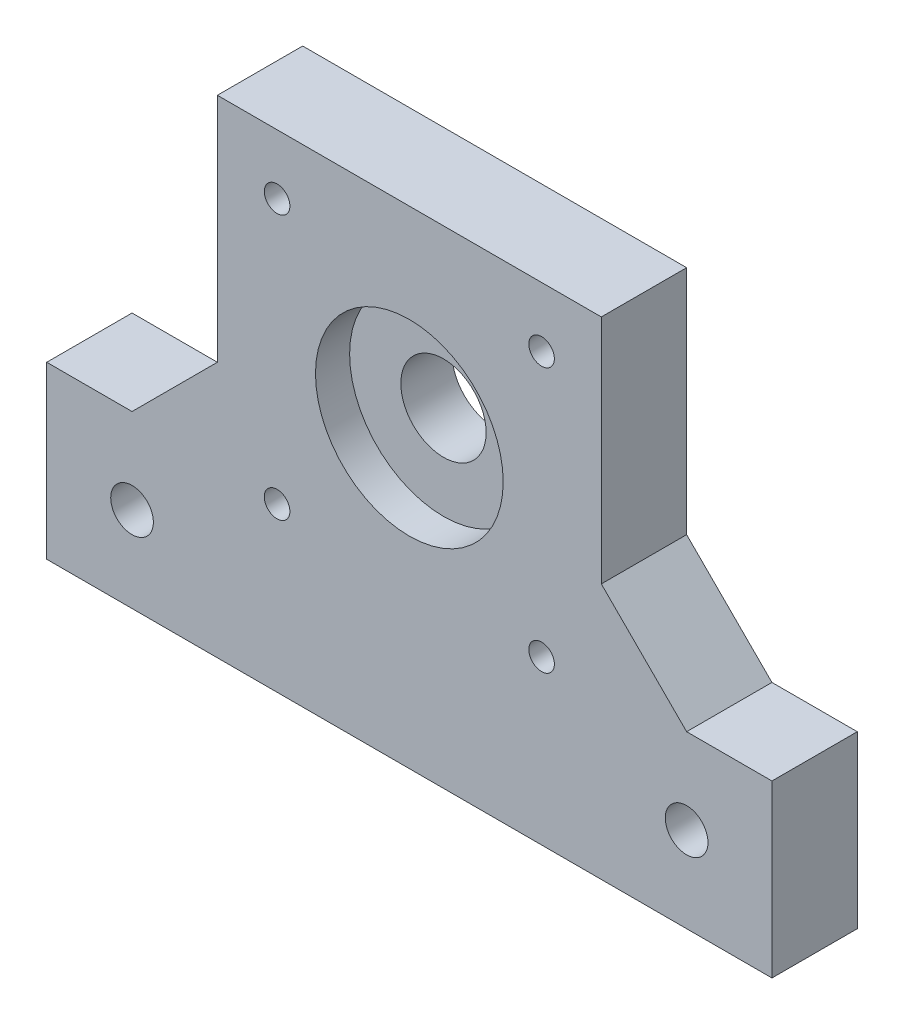
ISO-10303-21;
HEADER;
FILE_DESCRIPTION(('STEP AP214'),'2;1');
FILE_NAME('part.step','',(''),(''),'','','');
FILE_SCHEMA(('AUTOMOTIVE_DESIGN { 1 0 10303 214 1 1 1 1 }'));
ENDSEC;
DATA;
#1=APPLICATION_CONTEXT('core data for automotive mechanical design processes');
#2=APPLICATION_PROTOCOL_DEFINITION('international standard','automotive_design',2000,#1);
#3=PRODUCT_CONTEXT('',#1,'mechanical');
#4=PRODUCT('Part','Part','',(#3));
#5=PRODUCT_RELATED_PRODUCT_CATEGORY('part','',(#4));
#6=PRODUCT_DEFINITION_FORMATION('','',#4);
#7=PRODUCT_DEFINITION_CONTEXT('part definition',#1,'design');
#8=PRODUCT_DEFINITION('design','',#6,#7);
#9=PRODUCT_DEFINITION_SHAPE('','',#8);
#10=(LENGTH_UNIT() NAMED_UNIT(*) SI_UNIT(.MILLI.,.METRE.));
#11=(NAMED_UNIT(*) PLANE_ANGLE_UNIT() SI_UNIT($,.RADIAN.));
#12=(NAMED_UNIT(*) SI_UNIT($,.STERADIAN.) SOLID_ANGLE_UNIT());
#13=UNCERTAINTY_MEASURE_WITH_UNIT(LENGTH_MEASURE(1.E-05),#10,'distance_accuracy_value','');
#14=(GEOMETRIC_REPRESENTATION_CONTEXT(3) GLOBAL_UNCERTAINTY_ASSIGNED_CONTEXT((#13)) GLOBAL_UNIT_ASSIGNED_CONTEXT((#10,
#11,#12)) REPRESENTATION_CONTEXT('',''));
#15=CARTESIAN_POINT('',(0.,0.,0.));
#16=DIRECTION('',(0.,0.,1.));
#17=DIRECTION('',(1.,0.,0.));
#18=AXIS2_PLACEMENT_3D('',#15,#16,#17);
#19=CARTESIAN_POINT('',(15.5,15.5,10.));
#20=DIRECTION('',(0.,0.,-1.));
#21=DIRECTION('',(-1.,0.,0.));
#22=AXIS2_PLACEMENT_3D('',#19,#20,#21);
#23=CYLINDRICAL_SURFACE('',#22,1.5);
#24=CARTESIAN_POINT('',(15.5,15.5,10.));
#25=DIRECTION('',(0.,0.,1.));
#26=DIRECTION('',(-1.,0.,0.));
#27=AXIS2_PLACEMENT_3D('',#24,#25,#26);
#28=CIRCLE('',#27,1.5);
#29=CARTESIAN_POINT('',(14.,15.5,10.));
#30=VERTEX_POINT('',#29);
#31=EDGE_CURVE('E241',#30,#30,#28,.T.);
#32=ORIENTED_EDGE('',*,*,#31,.T.);
#33=EDGE_LOOP('',(#32));
#34=FACE_BOUND('',#33,.T.);
#35=CARTESIAN_POINT('',(15.5,15.5,4.));
#36=DIRECTION('',(0.,0.,-1.));
#37=DIRECTION('',(-1.,0.,0.));
#38=AXIS2_PLACEMENT_3D('',#35,#36,#37);
#39=CIRCLE('',#38,1.5);
#40=CARTESIAN_POINT('',(14.,15.5,4.));
#41=VERTEX_POINT('',#40);
#42=EDGE_CURVE('E208',#41,#41,#39,.T.);
#43=ORIENTED_EDGE('',*,*,#42,.T.);
#44=EDGE_LOOP('',(#43));
#45=FACE_BOUND('',#44,.T.);
#46=ADVANCED_FACE('F37',(#34,#45),#23,.F.);
#47=CARTESIAN_POINT('',(-15.5,-15.5,10.));
#48=DIRECTION('',(0.,0.,-1.));
#49=DIRECTION('',(-1.,0.,0.));
#50=AXIS2_PLACEMENT_3D('',#47,#48,#49);
#51=CYLINDRICAL_SURFACE('',#50,1.5);
#52=CARTESIAN_POINT('',(-15.5,-15.5,10.));
#53=DIRECTION('',(0.,0.,1.));
#54=DIRECTION('',(-1.,0.,0.));
#55=AXIS2_PLACEMENT_3D('',#52,#53,#54);
#56=CIRCLE('',#55,1.5);
#57=CARTESIAN_POINT('',(-17.,-15.5,10.));
#58=VERTEX_POINT('',#57);
#59=EDGE_CURVE('E233',#58,#58,#56,.T.);
#60=ORIENTED_EDGE('',*,*,#59,.T.);
#61=EDGE_LOOP('',(#60));
#62=FACE_BOUND('',#61,.T.);
#63=CARTESIAN_POINT('',(-15.5,-15.5,4.));
#64=DIRECTION('',(0.,0.,-1.));
#65=DIRECTION('',(-1.,0.,0.));
#66=AXIS2_PLACEMENT_3D('',#63,#64,#65);
#67=CIRCLE('',#66,1.5);
#68=CARTESIAN_POINT('',(-17.,-15.5,4.));
#69=VERTEX_POINT('',#68);
#70=EDGE_CURVE('E202',#69,#69,#67,.T.);
#71=ORIENTED_EDGE('',*,*,#70,.T.);
#72=EDGE_LOOP('',(#71));
#73=FACE_BOUND('',#72,.T.);
#74=ADVANCED_FACE('F281',(#62,#73),#51,.F.);
#75=CARTESIAN_POINT('',(0.,0.,10.));
#76=DIRECTION('',(0.,0.,-1.));
#77=DIRECTION('',(-1.,0.,0.));
#78=AXIS2_PLACEMENT_3D('',#75,#76,#77);
#79=CYLINDRICAL_SURFACE('',#78,5.);
#80=CARTESIAN_POINT('',(0.,0.,0.));
#81=DIRECTION('',(0.,0.,1.));
#82=DIRECTION('',(1.,0.,0.));
#83=AXIS2_PLACEMENT_3D('',#80,#81,#82);
#84=CIRCLE('',#83,5.);
#85=CARTESIAN_POINT('',(5.,0.,0.));
#86=VERTEX_POINT('',#85);
#87=EDGE_CURVE('E160',#86,#86,#84,.T.);
#88=ORIENTED_EDGE('',*,*,#87,.F.);
#89=EDGE_LOOP('',(#88));
#90=FACE_BOUND('',#89,.T.);
#91=CARTESIAN_POINT('',(0.,0.,6.));
#92=DIRECTION('',(0.,0.,1.));
#93=DIRECTION('',(1.,0.,0.));
#94=AXIS2_PLACEMENT_3D('',#91,#92,#93);
#95=CIRCLE('',#94,5.);
#96=CARTESIAN_POINT('',(5.,0.,6.));
#97=VERTEX_POINT('',#96);
#98=EDGE_CURVE('E186',#97,#97,#95,.T.);
#99=ORIENTED_EDGE('',*,*,#98,.T.);
#100=EDGE_LOOP('',(#99));
#101=FACE_BOUND('',#100,.T.);
#102=ADVANCED_FACE('F287',(#90,#101),#79,.F.);
#103=CARTESIAN_POINT('',(0.,0.,10.));
#104=DIRECTION('',(0.,0.,-1.));
#105=DIRECTION('',(-1.,0.,0.));
#106=AXIS2_PLACEMENT_3D('',#103,#104,#105);
#107=PLANE('',#106);
#108=CARTESIAN_POINT('',(0.,0.,10.));
#109=DIRECTION('',(0.,0.,1.));
#110=DIRECTION('',(1.,0.,0.));
#111=AXIS2_PLACEMENT_3D('',#108,#109,#110);
#112=CIRCLE('',#111,11.);
#113=CARTESIAN_POINT('',(11.,0.,10.));
#114=VERTEX_POINT('',#113);
#115=EDGE_CURVE('E213',#114,#114,#112,.T.);
#116=ORIENTED_EDGE('',*,*,#115,.F.);
#117=EDGE_LOOP('',(#116));
#118=FACE_BOUND('',#117,.T.);
#119=DIRECTION('',(0.,-1.,0.));
#120=VECTOR('',#119,1.);
#121=CARTESIAN_POINT('',(-22.5,22.5,10.));
#122=LINE('',#121,#120);
#123=CARTESIAN_POINT('',(-22.5,22.5,10.));
#124=VERTEX_POINT('',#123);
#125=CARTESIAN_POINT('',(-22.5,-4.60000000000002,10.));
#126=VERTEX_POINT('',#125);
#127=EDGE_CURVE('E128',#124,#126,#122,.T.);
#128=ORIENTED_EDGE('',*,*,#127,.T.);
#129=DIRECTION('',(0.707106781186552,0.707106781186543,0.));
#130=VECTOR('',#129,1.);
#131=CARTESIAN_POINT('',(-8.94999999999985,8.94999999999996,10.));
#132=LINE('',#131,#130);
#133=CARTESIAN_POINT('',(-32.5000000000001,-14.6,10.));
#134=VERTEX_POINT('',#133);
#135=EDGE_CURVE('E124',#126,#134,#132,.F.);
#136=ORIENTED_EDGE('',*,*,#135,.T.);
#137=DIRECTION('',(-1.,0.,0.));
#138=VECTOR('',#137,1.);
#139=CARTESIAN_POINT('',(-22.5,-14.6,10.));
#140=LINE('',#139,#138);
#141=CARTESIAN_POINT('',(-42.5,-14.6,10.));
#142=VERTEX_POINT('',#141);
#143=EDGE_CURVE('E115',#134,#142,#140,.T.);
#144=ORIENTED_EDGE('',*,*,#143,.T.);
#145=DIRECTION('',(0.,-1.,0.));
#146=VECTOR('',#145,1.);
#147=CARTESIAN_POINT('',(-42.5,-14.6,10.));
#148=LINE('',#147,#146);
#149=CARTESIAN_POINT('',(-42.5,-34.6,10.));
#150=VERTEX_POINT('',#149);
#151=EDGE_CURVE('E121',#142,#150,#148,.T.);
#152=ORIENTED_EDGE('',*,*,#151,.T.);
#153=DIRECTION('',(1.,0.,0.));
#154=VECTOR('',#153,1.);
#155=CARTESIAN_POINT('',(-42.5,-34.6,10.));
#156=LINE('',#155,#154);
#157=CARTESIAN_POINT('',(42.5,-34.6,10.));
#158=VERTEX_POINT('',#157);
#159=EDGE_CURVE('E143',#150,#158,#156,.T.);
#160=ORIENTED_EDGE('',*,*,#159,.T.);
#161=DIRECTION('',(0.,1.,0.));
#162=VECTOR('',#161,1.);
#163=CARTESIAN_POINT('',(42.5,-14.6,10.));
#164=LINE('',#163,#162);
#165=CARTESIAN_POINT('',(42.5,-14.6,10.));
#166=VERTEX_POINT('',#165);
#167=EDGE_CURVE('E145',#158,#166,#164,.T.);
#168=ORIENTED_EDGE('',*,*,#167,.T.);
#169=DIRECTION('',(-1.,0.,0.));
#170=VECTOR('',#169,1.);
#171=CARTESIAN_POINT('',(22.5,-14.6,10.));
#172=LINE('',#171,#170);
#173=CARTESIAN_POINT('',(32.4999999999999,-14.6,10.));
#174=VERTEX_POINT('',#173);
#175=EDGE_CURVE('E150',#166,#174,#172,.T.);
#176=ORIENTED_EDGE('',*,*,#175,.T.);
#177=DIRECTION('',(0.707106781186544,-0.707106781186551,0.));
#178=VECTOR('',#177,1.);
#179=CARTESIAN_POINT('',(8.95000000000015,8.95000000000005,10.));
#180=LINE('',#179,#178);
#181=CARTESIAN_POINT('',(22.5,-4.59999999999994,10.));
#182=VERTEX_POINT('',#181);
#183=EDGE_CURVE('E11',#174,#182,#180,.F.);
#184=ORIENTED_EDGE('',*,*,#183,.T.);
#185=DIRECTION('',(0.,1.,0.));
#186=VECTOR('',#185,1.);
#187=CARTESIAN_POINT('',(22.5,22.5,10.));
#188=LINE('',#187,#186);
#189=CARTESIAN_POINT('',(22.5,22.5,10.));
#190=VERTEX_POINT('',#189);
#191=EDGE_CURVE('E152',#182,#190,#188,.T.);
#192=ORIENTED_EDGE('',*,*,#191,.T.);
#193=DIRECTION('',(-1.,0.,0.));
#194=VECTOR('',#193,1.);
#195=CARTESIAN_POINT('',(22.5,22.5,10.));
#196=LINE('',#195,#194);
#197=EDGE_CURVE('E154',#190,#124,#196,.T.);
#198=ORIENTED_EDGE('',*,*,#197,.T.);
#199=EDGE_LOOP('',(#128,#136,#144,#152,#160,#168,#176,#184,#192,#198));
#200=FACE_BOUND('',#199,.T.);
#201=CARTESIAN_POINT('',(-15.5,15.5,10.));
#202=DIRECTION('',(0.,0.,1.));
#203=DIRECTION('',(1.,0.,0.));
#204=AXIS2_PLACEMENT_3D('',#201,#202,#203);
#205=CIRCLE('',#204,1.5);
#206=CARTESIAN_POINT('',(-14.,15.5,10.));
#207=VERTEX_POINT('',#206);
#208=EDGE_CURVE('E244',#207,#207,#205,.T.);
#209=ORIENTED_EDGE('',*,*,#208,.F.);
#210=EDGE_LOOP('',(#209));
#211=FACE_BOUND('',#210,.T.);
#212=ORIENTED_EDGE('',*,*,#31,.F.);
#213=EDGE_LOOP('',(#212));
#214=FACE_BOUND('',#213,.T.);
#215=CARTESIAN_POINT('',(15.5,-15.5,10.));
#216=DIRECTION('',(0.,0.,1.));
#217=DIRECTION('',(1.,0.,0.));
#218=AXIS2_PLACEMENT_3D('',#215,#216,#217);
#219=CIRCLE('',#218,1.5);
#220=CARTESIAN_POINT('',(17.,-15.5,10.));
#221=VERTEX_POINT('',#220);
#222=EDGE_CURVE('E238',#221,#221,#219,.T.);
#223=ORIENTED_EDGE('',*,*,#222,.F.);
#224=EDGE_LOOP('',(#223));
#225=FACE_BOUND('',#224,.T.);
#226=ORIENTED_EDGE('',*,*,#59,.F.);
#227=EDGE_LOOP('',(#226));
#228=FACE_BOUND('',#227,.T.);
#229=CARTESIAN_POINT('',(32.5,-24.6,10.));
#230=DIRECTION('',(0.,0.,1.));
#231=DIRECTION('',(1.,0.,0.));
#232=AXIS2_PLACEMENT_3D('',#229,#230,#231);
#233=CIRCLE('',#232,2.5);
#234=CARTESIAN_POINT('',(35.,-24.6,10.));
#235=VERTEX_POINT('',#234);
#236=EDGE_CURVE('E230',#235,#235,#233,.T.);
#237=ORIENTED_EDGE('',*,*,#236,.F.);
#238=EDGE_LOOP('',(#237));
#239=FACE_BOUND('',#238,.T.);
#240=CARTESIAN_POINT('',(-32.5,-24.6,10.));
#241=DIRECTION('',(0.,0.,1.));
#242=DIRECTION('',(-1.,0.,0.));
#243=AXIS2_PLACEMENT_3D('',#240,#241,#242);
#244=CIRCLE('',#243,2.5);
#245=CARTESIAN_POINT('',(-35.,-24.6,10.));
#246=VERTEX_POINT('',#245);
#247=EDGE_CURVE('E224',#246,#246,#244,.T.);
#248=ORIENTED_EDGE('',*,*,#247,.F.);
#249=EDGE_LOOP('',(#248));
#250=FACE_BOUND('',#249,.T.);
#251=ADVANCED_FACE('F118',(#118,#200,#211,#214,#225,#228,#239,#250),#107,.F.);
#252=CARTESIAN_POINT('',(0.,0.,0.));
#253=DIRECTION('',(0.,0.,-1.));
#254=DIRECTION('',(-1.,0.,0.));
#255=AXIS2_PLACEMENT_3D('',#252,#253,#254);
#256=PLANE('',#255);
#257=CARTESIAN_POINT('',(-15.5,15.5,0.));
#258=DIRECTION('',(0.,0.,-1.));
#259=DIRECTION('',(1.,0.,0.));
#260=AXIS2_PLACEMENT_3D('',#257,#258,#259);
#261=CIRCLE('',#260,2.85);
#262=CARTESIAN_POINT('',(-12.65,15.5,0.));
#263=VERTEX_POINT('',#262);
#264=EDGE_CURVE('E396',#263,#263,#261,.T.);
#265=ORIENTED_EDGE('',*,*,#264,.F.);
#266=EDGE_LOOP('',(#265));
#267=FACE_BOUND('',#266,.T.);
#268=CARTESIAN_POINT('',(15.5,-15.5,0.));
#269=DIRECTION('',(0.,0.,-1.));
#270=DIRECTION('',(1.,0.,0.));
#271=AXIS2_PLACEMENT_3D('',#268,#269,#270);
#272=CIRCLE('',#271,2.85);
#273=CARTESIAN_POINT('',(18.35,-15.5,0.));
#274=VERTEX_POINT('',#273);
#275=EDGE_CURVE('E383',#274,#274,#272,.T.);
#276=ORIENTED_EDGE('',*,*,#275,.F.);
#277=EDGE_LOOP('',(#276));
#278=FACE_BOUND('',#277,.T.);
#279=CARTESIAN_POINT('',(-15.5,-15.5,0.));
#280=DIRECTION('',(0.,0.,-1.));
#281=DIRECTION('',(-1.,0.,0.));
#282=AXIS2_PLACEMENT_3D('',#279,#280,#281);
#283=CIRCLE('',#282,2.85);
#284=CARTESIAN_POINT('',(-18.35,-15.5,0.));
#285=VERTEX_POINT('',#284);
#286=EDGE_CURVE('E384',#285,#285,#283,.T.);
#287=ORIENTED_EDGE('',*,*,#286,.F.);
#288=EDGE_LOOP('',(#287));
#289=FACE_BOUND('',#288,.T.);
#290=CARTESIAN_POINT('',(15.5,15.5,0.));
#291=DIRECTION('',(0.,0.,-1.));
#292=DIRECTION('',(-1.,0.,0.));
#293=AXIS2_PLACEMENT_3D('',#290,#291,#292);
#294=CIRCLE('',#293,2.85);
#295=CARTESIAN_POINT('',(12.65,15.5,0.));
#296=VERTEX_POINT('',#295);
#297=EDGE_CURVE('E395',#296,#296,#294,.T.);
#298=ORIENTED_EDGE('',*,*,#297,.F.);
#299=EDGE_LOOP('',(#298));
#300=FACE_BOUND('',#299,.T.);
#301=CARTESIAN_POINT('',(32.5,-24.6,0.));
#302=DIRECTION('',(0.,0.,1.));
#303=DIRECTION('',(1.,0.,0.));
#304=AXIS2_PLACEMENT_3D('',#301,#302,#303);
#305=CIRCLE('',#304,2.5);
#306=CARTESIAN_POINT('',(35.,-24.6,0.));
#307=VERTEX_POINT('',#306);
#308=EDGE_CURVE('E227',#307,#307,#305,.T.);
#309=ORIENTED_EDGE('',*,*,#308,.T.);
#310=EDGE_LOOP('',(#309));
#311=FACE_BOUND('',#310,.T.);
#312=DIRECTION('',(0.,-1.,0.));
#313=VECTOR('',#312,1.);
#314=CARTESIAN_POINT('',(-22.5,22.5,0.));
#315=LINE('',#314,#313);
#316=CARTESIAN_POINT('',(-22.5,22.5,0.));
#317=VERTEX_POINT('',#316);
#318=CARTESIAN_POINT('',(-22.5,-4.60000000000002,0.));
#319=VERTEX_POINT('',#318);
#320=EDGE_CURVE('E157',#317,#319,#315,.T.);
#321=ORIENTED_EDGE('',*,*,#320,.F.);
#322=DIRECTION('',(-1.,0.,0.));
#323=VECTOR('',#322,1.);
#324=CARTESIAN_POINT('',(22.5,22.5,0.));
#325=LINE('',#324,#323);
#326=CARTESIAN_POINT('',(22.5,22.5,0.));
#327=VERTEX_POINT('',#326);
#328=EDGE_CURVE('E172',#327,#317,#325,.T.);
#329=ORIENTED_EDGE('',*,*,#328,.F.);
#330=DIRECTION('',(0.,1.,0.));
#331=VECTOR('',#330,1.);
#332=CARTESIAN_POINT('',(22.5,22.5,0.));
#333=LINE('',#332,#331);
#334=CARTESIAN_POINT('',(22.5,-4.59999999999994,0.));
#335=VERTEX_POINT('',#334);
#336=EDGE_CURVE('E170',#335,#327,#333,.T.);
#337=ORIENTED_EDGE('',*,*,#336,.F.);
#338=DIRECTION('',(-0.707106781186544,0.707106781186551,0.));
#339=VECTOR('',#338,1.);
#340=CARTESIAN_POINT('',(22.5,-4.59999999999994,0.));
#341=LINE('',#340,#339);
#342=CARTESIAN_POINT('',(32.4999999999999,-14.6,0.));
#343=VERTEX_POINT('',#342);
#344=EDGE_CURVE('E46',#335,#343,#341,.F.);
#345=ORIENTED_EDGE('',*,*,#344,.T.);
#346=DIRECTION('',(-1.,0.,0.));
#347=VECTOR('',#346,1.);
#348=CARTESIAN_POINT('',(22.5,-14.6,0.));
#349=LINE('',#348,#347);
#350=CARTESIAN_POINT('',(42.5,-14.6,0.));
#351=VERTEX_POINT('',#350);
#352=EDGE_CURVE('E168',#351,#343,#349,.T.);
#353=ORIENTED_EDGE('',*,*,#352,.F.);
#354=DIRECTION('',(0.,1.,0.));
#355=VECTOR('',#354,1.);
#356=CARTESIAN_POINT('',(42.5,-14.6,0.));
#357=LINE('',#356,#355);
#358=CARTESIAN_POINT('',(42.5,-34.6,0.));
#359=VERTEX_POINT('',#358);
#360=EDGE_CURVE('E166',#359,#351,#357,.T.);
#361=ORIENTED_EDGE('',*,*,#360,.F.);
#362=DIRECTION('',(1.,0.,0.));
#363=VECTOR('',#362,1.);
#364=CARTESIAN_POINT('',(-42.5,-34.6,0.));
#365=LINE('',#364,#363);
#366=CARTESIAN_POINT('',(-42.5,-34.6,0.));
#367=VERTEX_POINT('',#366);
#368=EDGE_CURVE('E164',#367,#359,#365,.T.);
#369=ORIENTED_EDGE('',*,*,#368,.F.);
#370=DIRECTION('',(0.,-1.,0.));
#371=VECTOR('',#370,1.);
#372=CARTESIAN_POINT('',(-42.5,-14.6,0.));
#373=LINE('',#372,#371);
#374=CARTESIAN_POINT('',(-42.5,-14.6,0.));
#375=VERTEX_POINT('',#374);
#376=EDGE_CURVE('E162',#375,#367,#373,.T.);
#377=ORIENTED_EDGE('',*,*,#376,.F.);
#378=DIRECTION('',(-1.,0.,0.));
#379=VECTOR('',#378,1.);
#380=CARTESIAN_POINT('',(-22.5,-14.6,0.));
#381=LINE('',#380,#379);
#382=CARTESIAN_POINT('',(-32.5000000000001,-14.6,0.));
#383=VERTEX_POINT('',#382);
#384=EDGE_CURVE('E134',#383,#375,#381,.T.);
#385=ORIENTED_EDGE('',*,*,#384,.F.);
#386=DIRECTION('',(-0.707106781186552,-0.707106781186543,0.));
#387=VECTOR('',#386,1.);
#388=CARTESIAN_POINT('',(-32.5000000000001,-14.6,0.));
#389=LINE('',#388,#387);
#390=EDGE_CURVE('E198',#383,#319,#389,.F.);
#391=ORIENTED_EDGE('',*,*,#390,.T.);
#392=EDGE_LOOP('',(#321,#329,#337,#345,#353,#361,#369,#377,#385,#391));
#393=FACE_BOUND('',#392,.T.);
#394=ORIENTED_EDGE('',*,*,#87,.T.);
#395=EDGE_LOOP('',(#394));
#396=FACE_BOUND('',#395,.T.);
#397=CARTESIAN_POINT('',(-32.5,-24.6,0.));
#398=DIRECTION('',(0.,0.,1.));
#399=DIRECTION('',(-1.,0.,0.));
#400=AXIS2_PLACEMENT_3D('',#397,#398,#399);
#401=CIRCLE('',#400,2.5);
#402=CARTESIAN_POINT('',(-35.,-24.6,0.));
#403=VERTEX_POINT('',#402);
#404=EDGE_CURVE('E189',#403,#403,#401,.T.);
#405=ORIENTED_EDGE('',*,*,#404,.T.);
#406=EDGE_LOOP('',(#405));
#407=FACE_BOUND('',#406,.T.);
#408=ADVANCED_FACE('F256',(#267,#278,#289,#300,#311,#393,#396,#407),#256,.T.);
#409=CARTESIAN_POINT('',(-22.5,22.5,10.));
#410=DIRECTION('',(1.,0.,0.));
#411=DIRECTION('',(0.,1.,0.));
#412=AXIS2_PLACEMENT_3D('',#409,#410,#411);
#413=PLANE('',#412);
#414=ORIENTED_EDGE('',*,*,#320,.T.);
#415=DIRECTION('',(0.,0.,1.));
#416=VECTOR('',#415,1.);
#417=CARTESIAN_POINT('',(-22.5,-4.60000000000002,10.));
#418=LINE('',#417,#416);
#419=EDGE_CURVE('E192',#319,#126,#418,.T.);
#420=ORIENTED_EDGE('',*,*,#419,.T.);
#421=ORIENTED_EDGE('',*,*,#127,.F.);
#422=DIRECTION('',(0.,0.,-1.));
#423=VECTOR('',#422,1.);
#424=CARTESIAN_POINT('',(-22.5,22.5,10.));
#425=LINE('',#424,#423);
#426=EDGE_CURVE('E156',#124,#317,#425,.T.);
#427=ORIENTED_EDGE('',*,*,#426,.T.);
#428=EDGE_LOOP('',(#414,#420,#421,#427));
#429=FACE_BOUND('',#428,.T.);
#430=ADVANCED_FACE('F305',(#429),#413,.F.);
#431=CARTESIAN_POINT('',(-22.5,-14.6,10.));
#432=DIRECTION('',(0.,-1.,0.));
#433=DIRECTION('',(1.,0.,0.));
#434=AXIS2_PLACEMENT_3D('',#431,#432,#433);
#435=PLANE('',#434);
#436=ORIENTED_EDGE('',*,*,#143,.F.);
#437=DIRECTION('',(0.,0.,-1.));
#438=VECTOR('',#437,1.);
#439=CARTESIAN_POINT('',(-32.5000000000001,-14.6,0.));
#440=LINE('',#439,#438);
#441=EDGE_CURVE('E137',#134,#383,#440,.T.);
#442=ORIENTED_EDGE('',*,*,#441,.T.);
#443=ORIENTED_EDGE('',*,*,#384,.T.);
#444=DIRECTION('',(0.,0.,-1.));
#445=VECTOR('',#444,1.);
#446=CARTESIAN_POINT('',(-42.5,-14.6,10.));
#447=LINE('',#446,#445);
#448=EDGE_CURVE('E131',#142,#375,#447,.T.);
#449=ORIENTED_EDGE('',*,*,#448,.F.);
#450=EDGE_LOOP('',(#436,#442,#443,#449));
#451=FACE_BOUND('',#450,.T.);
#452=ADVANCED_FACE('F132',(#451),#435,.F.);
#453=CARTESIAN_POINT('',(-42.5,-14.6,10.));
#454=DIRECTION('',(1.,0.,0.));
#455=DIRECTION('',(0.,0.,-1.));
#456=AXIS2_PLACEMENT_3D('',#453,#454,#455);
#457=PLANE('',#456);
#458=ORIENTED_EDGE('',*,*,#376,.T.);
#459=DIRECTION('',(0.,0.,-1.));
#460=VECTOR('',#459,1.);
#461=CARTESIAN_POINT('',(-42.5,-34.6,10.));
#462=LINE('',#461,#460);
#463=EDGE_CURVE('E138',#150,#367,#462,.T.);
#464=ORIENTED_EDGE('',*,*,#463,.F.);
#465=ORIENTED_EDGE('',*,*,#151,.F.);
#466=ORIENTED_EDGE('',*,*,#448,.T.);
#467=EDGE_LOOP('',(#458,#464,#465,#466));
#468=FACE_BOUND('',#467,.T.);
#469=ADVANCED_FACE('F140',(#468),#457,.F.);
#470=CARTESIAN_POINT('',(-42.5,-34.6,10.));
#471=DIRECTION('',(0.,1.,0.));
#472=DIRECTION('',(-1.,0.,0.));
#473=AXIS2_PLACEMENT_3D('',#470,#471,#472);
#474=PLANE('',#473);
#475=ORIENTED_EDGE('',*,*,#368,.T.);
#476=DIRECTION('',(0.,0.,-1.));
#477=VECTOR('',#476,1.);
#478=CARTESIAN_POINT('',(42.5,-34.6,10.));
#479=LINE('',#478,#477);
#480=EDGE_CURVE('E182',#158,#359,#479,.T.);
#481=ORIENTED_EDGE('',*,*,#480,.F.);
#482=ORIENTED_EDGE('',*,*,#159,.F.);
#483=ORIENTED_EDGE('',*,*,#463,.T.);
#484=EDGE_LOOP('',(#475,#481,#482,#483));
#485=FACE_BOUND('',#484,.T.);
#486=ADVANCED_FACE('F261',(#485),#474,.F.);
#487=CARTESIAN_POINT('',(42.5,-14.6,10.));
#488=DIRECTION('',(-1.,0.,0.));
#489=DIRECTION('',(0.,0.,1.));
#490=AXIS2_PLACEMENT_3D('',#487,#488,#489);
#491=PLANE('',#490);
#492=ORIENTED_EDGE('',*,*,#360,.T.);
#493=DIRECTION('',(0.,0.,-1.));
#494=VECTOR('',#493,1.);
#495=CARTESIAN_POINT('',(42.5,-14.6,10.));
#496=LINE('',#495,#494);
#497=EDGE_CURVE('E179',#166,#351,#496,.T.);
#498=ORIENTED_EDGE('',*,*,#497,.F.);
#499=ORIENTED_EDGE('',*,*,#167,.F.);
#500=ORIENTED_EDGE('',*,*,#480,.T.);
#501=EDGE_LOOP('',(#492,#498,#499,#500));
#502=FACE_BOUND('',#501,.T.);
#503=ADVANCED_FACE('F267',(#502),#491,.F.);
#504=CARTESIAN_POINT('',(22.5,-14.6,10.));
#505=DIRECTION('',(0.,-1.,0.));
#506=DIRECTION('',(1.,0.,0.));
#507=AXIS2_PLACEMENT_3D('',#504,#505,#506);
#508=PLANE('',#507);
#509=ORIENTED_EDGE('',*,*,#352,.T.);
#510=DIRECTION('',(0.,0.,1.));
#511=VECTOR('',#510,1.);
#512=CARTESIAN_POINT('',(32.4999999999999,-14.6,10.));
#513=LINE('',#512,#511);
#514=EDGE_CURVE('E54',#343,#174,#513,.T.);
#515=ORIENTED_EDGE('',*,*,#514,.T.);
#516=ORIENTED_EDGE('',*,*,#175,.F.);
#517=ORIENTED_EDGE('',*,*,#497,.T.);
#518=EDGE_LOOP('',(#509,#515,#516,#517));
#519=FACE_BOUND('',#518,.T.);
#520=ADVANCED_FACE('F268',(#519),#508,.F.);
#521=CARTESIAN_POINT('',(22.5,22.5,10.));
#522=DIRECTION('',(-1.,0.,0.));
#523=DIRECTION('',(0.,-1.,0.));
#524=AXIS2_PLACEMENT_3D('',#521,#522,#523);
#525=PLANE('',#524);
#526=ORIENTED_EDGE('',*,*,#191,.F.);
#527=DIRECTION('',(0.,0.,-1.));
#528=VECTOR('',#527,1.);
#529=CARTESIAN_POINT('',(22.5,-4.59999999999994,0.));
#530=LINE('',#529,#528);
#531=EDGE_CURVE('E194',#182,#335,#530,.T.);
#532=ORIENTED_EDGE('',*,*,#531,.T.);
#533=ORIENTED_EDGE('',*,*,#336,.T.);
#534=DIRECTION('',(0.,0.,-1.));
#535=VECTOR('',#534,1.);
#536=CARTESIAN_POINT('',(22.5,22.5,10.));
#537=LINE('',#536,#535);
#538=EDGE_CURVE('E176',#190,#327,#537,.T.);
#539=ORIENTED_EDGE('',*,*,#538,.F.);
#540=EDGE_LOOP('',(#526,#532,#533,#539));
#541=FACE_BOUND('',#540,.T.);
#542=ADVANCED_FACE('F270',(#541),#525,.F.);
#543=CARTESIAN_POINT('',(22.5,22.5,10.));
#544=DIRECTION('',(0.,-1.,0.));
#545=DIRECTION('',(1.,0.,0.));
#546=AXIS2_PLACEMENT_3D('',#543,#544,#545);
#547=PLANE('',#546);
#548=ORIENTED_EDGE('',*,*,#328,.T.);
#549=ORIENTED_EDGE('',*,*,#426,.F.);
#550=ORIENTED_EDGE('',*,*,#197,.F.);
#551=ORIENTED_EDGE('',*,*,#538,.T.);
#552=EDGE_LOOP('',(#548,#549,#550,#551));
#553=FACE_BOUND('',#552,.T.);
#554=ADVANCED_FACE('F276',(#553),#547,.F.);
#555=CARTESIAN_POINT('',(-15.5,15.5,10.));
#556=DIRECTION('',(0.,0.,-1.));
#557=DIRECTION('',(-1.,0.,0.));
#558=AXIS2_PLACEMENT_3D('',#555,#556,#557);
#559=CYLINDRICAL_SURFACE('',#558,1.5);
#560=CARTESIAN_POINT('',(-15.5,15.5,4.));
#561=DIRECTION('',(0.,0.,1.));
#562=DIRECTION('',(1.,0.,0.));
#563=AXIS2_PLACEMENT_3D('',#560,#561,#562);
#564=CIRCLE('',#563,1.5);
#565=CARTESIAN_POINT('',(-14.,15.5,4.));
#566=VERTEX_POINT('',#565);
#567=EDGE_CURVE('E41',#566,#566,#564,.T.);
#568=ORIENTED_EDGE('',*,*,#567,.F.);
#569=EDGE_LOOP('',(#568));
#570=FACE_BOUND('',#569,.T.);
#571=ORIENTED_EDGE('',*,*,#208,.T.);
#572=EDGE_LOOP('',(#571));
#573=FACE_BOUND('',#572,.T.);
#574=ADVANCED_FACE('F293',(#570,#573),#559,.F.);
#575=CARTESIAN_POINT('',(15.5,-15.5,10.));
#576=DIRECTION('',(0.,0.,-1.));
#577=DIRECTION('',(-1.,0.,0.));
#578=AXIS2_PLACEMENT_3D('',#575,#576,#577);
#579=CYLINDRICAL_SURFACE('',#578,1.5);
#580=CARTESIAN_POINT('',(15.5,-15.5,4.));
#581=DIRECTION('',(0.,0.,1.));
#582=DIRECTION('',(1.,0.,0.));
#583=AXIS2_PLACEMENT_3D('',#580,#581,#582);
#584=CIRCLE('',#583,1.5);
#585=CARTESIAN_POINT('',(17.,-15.5,4.));
#586=VERTEX_POINT('',#585);
#587=EDGE_CURVE('E205',#586,#586,#584,.T.);
#588=ORIENTED_EDGE('',*,*,#587,.F.);
#589=EDGE_LOOP('',(#588));
#590=FACE_BOUND('',#589,.T.);
#591=ORIENTED_EDGE('',*,*,#222,.T.);
#592=EDGE_LOOP('',(#591));
#593=FACE_BOUND('',#592,.T.);
#594=ADVANCED_FACE('F292',(#590,#593),#579,.F.);
#595=CARTESIAN_POINT('',(32.5,-24.6,10.));
#596=DIRECTION('',(0.,0.,-1.));
#597=DIRECTION('',(-1.,0.,0.));
#598=AXIS2_PLACEMENT_3D('',#595,#596,#597);
#599=CYLINDRICAL_SURFACE('',#598,2.5);
#600=ORIENTED_EDGE('',*,*,#236,.T.);
#601=EDGE_LOOP('',(#600));
#602=FACE_BOUND('',#601,.T.);
#603=ORIENTED_EDGE('',*,*,#308,.F.);
#604=EDGE_LOOP('',(#603));
#605=FACE_BOUND('',#604,.T.);
#606=ADVANCED_FACE('F345',(#602,#605),#599,.F.);
#607=CARTESIAN_POINT('',(-32.5,-24.6,10.));
#608=DIRECTION('',(0.,0.,-1.));
#609=DIRECTION('',(-1.,0.,0.));
#610=AXIS2_PLACEMENT_3D('',#607,#608,#609);
#611=CYLINDRICAL_SURFACE('',#610,2.5);
#612=ORIENTED_EDGE('',*,*,#247,.T.);
#613=EDGE_LOOP('',(#612));
#614=FACE_BOUND('',#613,.T.);
#615=ORIENTED_EDGE('',*,*,#404,.F.);
#616=EDGE_LOOP('',(#615));
#617=FACE_BOUND('',#616,.T.);
#618=ADVANCED_FACE('F334',(#614,#617),#611,.F.);
#619=CARTESIAN_POINT('',(0.,0.,6.));
#620=DIRECTION('',(0.,0.,1.));
#621=DIRECTION('',(1.,0.,0.));
#622=AXIS2_PLACEMENT_3D('',#619,#620,#621);
#623=CYLINDRICAL_SURFACE('',#622,11.);
#624=CARTESIAN_POINT('',(0.,0.,6.));
#625=DIRECTION('',(0.,0.,1.));
#626=DIRECTION('',(1.,0.,0.));
#627=AXIS2_PLACEMENT_3D('',#624,#625,#626);
#628=CIRCLE('',#627,11.);
#629=CARTESIAN_POINT('',(11.,0.,6.));
#630=VERTEX_POINT('',#629);
#631=EDGE_CURVE('E190',#630,#630,#628,.T.);
#632=ORIENTED_EDGE('',*,*,#631,.F.);
#633=EDGE_LOOP('',(#632));
#634=FACE_BOUND('',#633,.T.);
#635=ORIENTED_EDGE('',*,*,#115,.T.);
#636=EDGE_LOOP('',(#635));
#637=FACE_BOUND('',#636,.T.);
#638=ADVANCED_FACE('F328',(#634,#637),#623,.F.);
#639=CARTESIAN_POINT('',(0.,0.,6.));
#640=DIRECTION('',(0.,0.,1.));
#641=DIRECTION('',(1.,0.,0.));
#642=AXIS2_PLACEMENT_3D('',#639,#640,#641);
#643=PLANE('',#642);
#644=ORIENTED_EDGE('',*,*,#98,.F.);
#645=EDGE_LOOP('',(#644));
#646=FACE_BOUND('',#645,.T.);
#647=ORIENTED_EDGE('',*,*,#631,.T.);
#648=EDGE_LOOP('',(#647));
#649=FACE_BOUND('',#648,.T.);
#650=ADVANCED_FACE('F321',(#646,#649),#643,.T.);
#651=CARTESIAN_POINT('',(-32.5000000000001,-14.6,10.));
#652=DIRECTION('',(-0.707106781186543,0.707106781186552,0.));
#653=DIRECTION('',(0.,0.,1.));
#654=AXIS2_PLACEMENT_3D('',#651,#652,#653);
#655=PLANE('',#654);
#656=ORIENTED_EDGE('',*,*,#135,.F.);
#657=ORIENTED_EDGE('',*,*,#419,.F.);
#658=ORIENTED_EDGE('',*,*,#390,.F.);
#659=ORIENTED_EDGE('',*,*,#441,.F.);
#660=EDGE_LOOP('',(#656,#657,#658,#659));
#661=FACE_BOUND('',#660,.T.);
#662=ADVANCED_FACE('F254',(#661),#655,.T.);
#663=CARTESIAN_POINT('',(22.5,-4.59999999999994,10.));
#664=DIRECTION('',(0.707106781186551,0.707106781186544,0.));
#665=DIRECTION('',(0.,0.,1.));
#666=AXIS2_PLACEMENT_3D('',#663,#664,#665);
#667=PLANE('',#666);
#668=ORIENTED_EDGE('',*,*,#183,.F.);
#669=ORIENTED_EDGE('',*,*,#514,.F.);
#670=ORIENTED_EDGE('',*,*,#344,.F.);
#671=ORIENTED_EDGE('',*,*,#531,.F.);
#672=EDGE_LOOP('',(#668,#669,#670,#671));
#673=FACE_BOUND('',#672,.T.);
#674=ADVANCED_FACE('F39',(#673),#667,.T.);
#675=CARTESIAN_POINT('',(-15.5,-15.5,4.));
#676=DIRECTION('',(0.,0.,-1.));
#677=DIRECTION('',(-1.,0.,0.));
#678=AXIS2_PLACEMENT_3D('',#675,#676,#677);
#679=CYLINDRICAL_SURFACE('',#678,2.85);
#680=CARTESIAN_POINT('',(-15.5,-15.5,4.));
#681=DIRECTION('',(0.,0.,-1.));
#682=DIRECTION('',(-1.,0.,0.));
#683=AXIS2_PLACEMENT_3D('',#680,#681,#682);
#684=CIRCLE('',#683,2.85);
#685=CARTESIAN_POINT('',(-18.35,-15.5,4.));
#686=VERTEX_POINT('',#685);
#687=EDGE_CURVE('E381',#686,#686,#684,.T.);
#688=ORIENTED_EDGE('',*,*,#687,.F.);
#689=EDGE_LOOP('',(#688));
#690=FACE_BOUND('',#689,.T.);
#691=ORIENTED_EDGE('',*,*,#286,.T.);
#692=EDGE_LOOP('',(#691));
#693=FACE_BOUND('',#692,.T.);
#694=ADVANCED_FACE('F326',(#690,#693),#679,.F.);
#695=CARTESIAN_POINT('',(-15.5,-15.5,4.));
#696=DIRECTION('',(0.,0.,-1.));
#697=DIRECTION('',(-1.,0.,0.));
#698=AXIS2_PLACEMENT_3D('',#695,#696,#697);
#699=PLANE('',#698);
#700=ORIENTED_EDGE('',*,*,#70,.F.);
#701=EDGE_LOOP('',(#700));
#702=FACE_BOUND('',#701,.T.);
#703=ORIENTED_EDGE('',*,*,#687,.T.);
#704=EDGE_LOOP('',(#703));
#705=FACE_BOUND('',#704,.T.);
#706=ADVANCED_FACE('F374',(#702,#705),#699,.T.);
#707=CARTESIAN_POINT('',(15.5,-15.5,4.));
#708=DIRECTION('',(0.,0.,-1.));
#709=DIRECTION('',(-1.,0.,0.));
#710=AXIS2_PLACEMENT_3D('',#707,#708,#709);
#711=CYLINDRICAL_SURFACE('',#710,2.85);
#712=CARTESIAN_POINT('',(15.5,-15.5,4.));
#713=DIRECTION('',(0.,0.,-1.));
#714=DIRECTION('',(1.,0.,0.));
#715=AXIS2_PLACEMENT_3D('',#712,#713,#714);
#716=CIRCLE('',#715,2.85);
#717=CARTESIAN_POINT('',(18.35,-15.5,4.));
#718=VERTEX_POINT('',#717);
#719=EDGE_CURVE('E387',#718,#718,#716,.T.);
#720=ORIENTED_EDGE('',*,*,#719,.F.);
#721=EDGE_LOOP('',(#720));
#722=FACE_BOUND('',#721,.T.);
#723=ORIENTED_EDGE('',*,*,#275,.T.);
#724=EDGE_LOOP('',(#723));
#725=FACE_BOUND('',#724,.T.);
#726=ADVANCED_FACE('F377',(#722,#725),#711,.F.);
#727=CARTESIAN_POINT('',(15.5,-15.5,4.));
#728=DIRECTION('',(0.,0.,1.));
#729=DIRECTION('',(1.,0.,0.));
#730=AXIS2_PLACEMENT_3D('',#727,#728,#729);
#731=PLANE('',#730);
#732=ORIENTED_EDGE('',*,*,#587,.T.);
#733=EDGE_LOOP('',(#732));
#734=FACE_BOUND('',#733,.T.);
#735=ORIENTED_EDGE('',*,*,#719,.T.);
#736=EDGE_LOOP('',(#735));
#737=FACE_BOUND('',#736,.T.);
#738=ADVANCED_FACE('F408',(#734,#737),#731,.F.);
#739=CARTESIAN_POINT('',(15.5,15.5,4.));
#740=DIRECTION('',(0.,0.,-1.));
#741=DIRECTION('',(-1.,0.,0.));
#742=AXIS2_PLACEMENT_3D('',#739,#740,#741);
#743=CYLINDRICAL_SURFACE('',#742,2.85);
#744=CARTESIAN_POINT('',(15.5,15.5,4.));
#745=DIRECTION('',(0.,0.,-1.));
#746=DIRECTION('',(-1.,0.,0.));
#747=AXIS2_PLACEMENT_3D('',#744,#745,#746);
#748=CIRCLE('',#747,2.85);
#749=CARTESIAN_POINT('',(12.65,15.5,4.));
#750=VERTEX_POINT('',#749);
#751=EDGE_CURVE('E206',#750,#750,#748,.T.);
#752=ORIENTED_EDGE('',*,*,#751,.F.);
#753=EDGE_LOOP('',(#752));
#754=FACE_BOUND('',#753,.T.);
#755=ORIENTED_EDGE('',*,*,#297,.T.);
#756=EDGE_LOOP('',(#755));
#757=FACE_BOUND('',#756,.T.);
#758=ADVANCED_FACE('F340',(#754,#757),#743,.F.);
#759=CARTESIAN_POINT('',(15.5,15.5,4.));
#760=DIRECTION('',(0.,0.,-1.));
#761=DIRECTION('',(-1.,0.,0.));
#762=AXIS2_PLACEMENT_3D('',#759,#760,#761);
#763=PLANE('',#762);
#764=ORIENTED_EDGE('',*,*,#42,.F.);
#765=EDGE_LOOP('',(#764));
#766=FACE_BOUND('',#765,.T.);
#767=ORIENTED_EDGE('',*,*,#751,.T.);
#768=EDGE_LOOP('',(#767));
#769=FACE_BOUND('',#768,.T.);
#770=ADVANCED_FACE('F407',(#766,#769),#763,.T.);
#771=CARTESIAN_POINT('',(-15.5,15.5,4.));
#772=DIRECTION('',(0.,0.,-1.));
#773=DIRECTION('',(-1.,0.,0.));
#774=AXIS2_PLACEMENT_3D('',#771,#772,#773);
#775=CYLINDRICAL_SURFACE('',#774,2.85);
#776=CARTESIAN_POINT('',(-15.5,15.5,4.));
#777=DIRECTION('',(0.,0.,-1.));
#778=DIRECTION('',(1.,0.,0.));
#779=AXIS2_PLACEMENT_3D('',#776,#777,#778);
#780=CIRCLE('',#779,2.85);
#781=CARTESIAN_POINT('',(-12.65,15.5,4.));
#782=VERTEX_POINT('',#781);
#783=EDGE_CURVE('E392',#782,#782,#780,.T.);
#784=ORIENTED_EDGE('',*,*,#783,.F.);
#785=EDGE_LOOP('',(#784));
#786=FACE_BOUND('',#785,.T.);
#787=ORIENTED_EDGE('',*,*,#264,.T.);
#788=EDGE_LOOP('',(#787));
#789=FACE_BOUND('',#788,.T.);
#790=ADVANCED_FACE('F414',(#786,#789),#775,.F.);
#791=CARTESIAN_POINT('',(-15.5,15.5,4.));
#792=DIRECTION('',(0.,0.,1.));
#793=DIRECTION('',(1.,0.,0.));
#794=AXIS2_PLACEMENT_3D('',#791,#792,#793);
#795=PLANE('',#794);
#796=ORIENTED_EDGE('',*,*,#567,.T.);
#797=EDGE_LOOP('',(#796));
#798=FACE_BOUND('',#797,.T.);
#799=ORIENTED_EDGE('',*,*,#783,.T.);
#800=EDGE_LOOP('',(#799));
#801=FACE_BOUND('',#800,.T.);
#802=ADVANCED_FACE('F429',(#798,#801),#795,.F.);
#803=CLOSED_SHELL('',(#46,#74,#102,#251,#408,#430,#452,#469,#486,#503,#520,#542,#554,#574,#594,
#606,#618,#638,#650,#662,#674,#694,#706,#726,#738,#758,#770,#790,#802));
#804=MANIFOLD_SOLID_BREP('B2',#803);
#805=ADVANCED_BREP_SHAPE_REPRESENTATION('',(#18,#804),#14);
#806=SHAPE_DEFINITION_REPRESENTATION(#9,#805);
ENDSEC;
END-ISO-10303-21;
